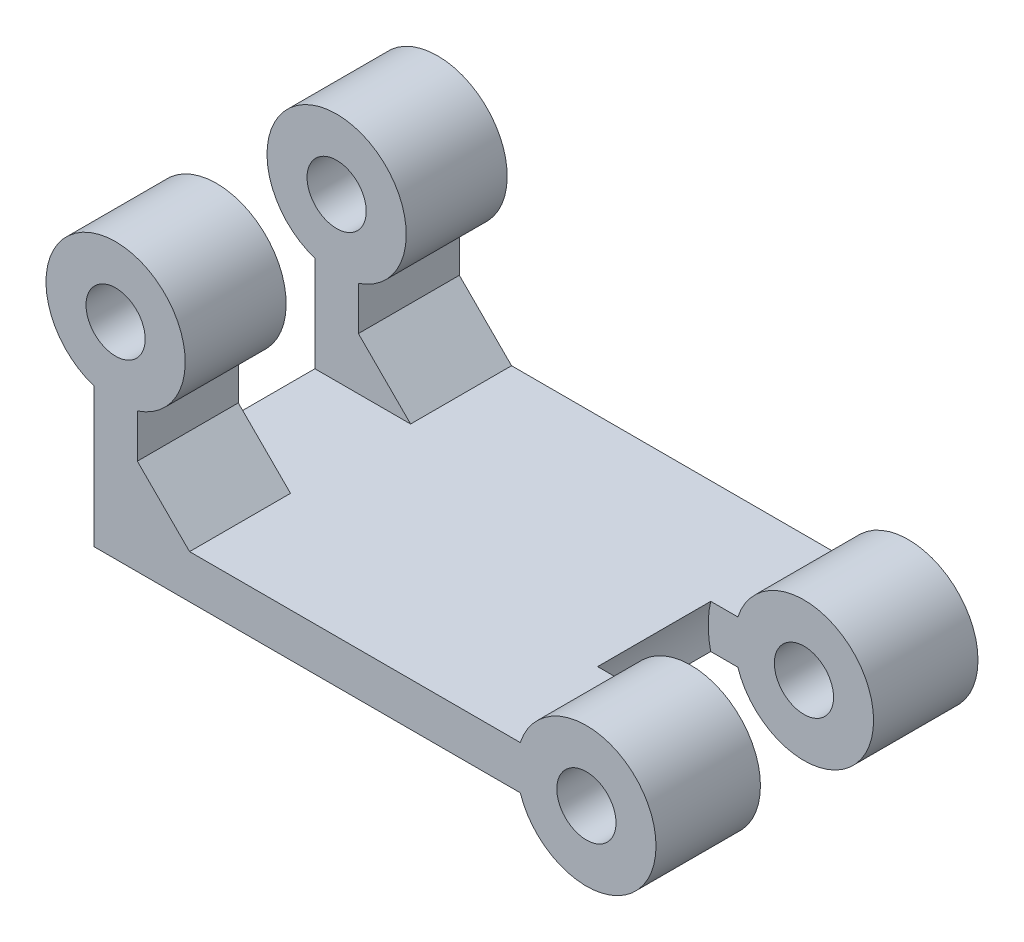
ISO-10303-21;
HEADER;
FILE_DESCRIPTION(('STEP AP214'),'2;1');
FILE_NAME('part.step','',(''),(''),'','','');
FILE_SCHEMA(('AUTOMOTIVE_DESIGN { 1 0 10303 214 1 1 1 1 }'));
ENDSEC;
DATA;
#1=APPLICATION_CONTEXT('core data for automotive mechanical design processes');
#2=APPLICATION_PROTOCOL_DEFINITION('international standard','automotive_design',2000,#1);
#3=PRODUCT_CONTEXT('',#1,'mechanical');
#4=PRODUCT('Part','Part','',(#3));
#5=PRODUCT_RELATED_PRODUCT_CATEGORY('part','',(#4));
#6=PRODUCT_DEFINITION_FORMATION('','',#4);
#7=PRODUCT_DEFINITION_CONTEXT('part definition',#1,'design');
#8=PRODUCT_DEFINITION('design','',#6,#7);
#9=PRODUCT_DEFINITION_SHAPE('','',#8);
#10=(LENGTH_UNIT() NAMED_UNIT(*) SI_UNIT(.MILLI.,.METRE.));
#11=(NAMED_UNIT(*) PLANE_ANGLE_UNIT() SI_UNIT($,.RADIAN.));
#12=(NAMED_UNIT(*) SI_UNIT($,.STERADIAN.) SOLID_ANGLE_UNIT());
#13=UNCERTAINTY_MEASURE_WITH_UNIT(LENGTH_MEASURE(1.E-05),#10,'distance_accuracy_value','');
#14=(GEOMETRIC_REPRESENTATION_CONTEXT(3) GLOBAL_UNCERTAINTY_ASSIGNED_CONTEXT((#13)) GLOBAL_UNIT_ASSIGNED_CONTEXT((#10,
#11,#12)) REPRESENTATION_CONTEXT('',''));
#15=CARTESIAN_POINT('',(0.,0.,0.));
#16=DIRECTION('',(0.,0.,1.));
#17=DIRECTION('',(1.,0.,0.));
#18=AXIS2_PLACEMENT_3D('',#15,#16,#17);
#19=CARTESIAN_POINT('',(-25.7996710383927,1.25,49.9990810170936));
#20=DIRECTION('',(1.,0.,0.));
#21=DIRECTION('',(0.,0.,-1.));
#22=AXIS2_PLACEMENT_3D('',#19,#20,#21);
#23=PLANE('',#22);
#24=DIRECTION('',(0.,-1.,0.));
#25=VECTOR('',#24,1.);
#26=CARTESIAN_POINT('',(-25.7996710383927,1.25,18.5));
#27=LINE('',#26,#25);
#28=CARTESIAN_POINT('',(-25.7996710383927,6.75,18.5));
#29=VERTEX_POINT('',#28);
#30=CARTESIAN_POINT('',(-25.7996710383927,4.25000000000002,18.5));
#31=VERTEX_POINT('',#30);
#32=EDGE_CURVE('E283',#29,#31,#27,.T.);
#33=ORIENTED_EDGE('',*,*,#32,.T.);
#34=DIRECTION('',(0.,0.,-1.));
#35=VECTOR('',#34,1.);
#36=CARTESIAN_POINT('',(-25.7996710383927,4.25000000000002,12.7));
#37=LINE('',#36,#35);
#38=CARTESIAN_POINT('',(-25.7996710383927,4.25000000000002,12.7));
#39=VERTEX_POINT('',#38);
#40=EDGE_CURVE('E205',#31,#39,#37,.T.);
#41=ORIENTED_EDGE('',*,*,#40,.T.);
#42=DIRECTION('',(0.,-1.,0.));
#43=VECTOR('',#42,1.);
#44=CARTESIAN_POINT('',(-25.7996710383927,1.25,12.7));
#45=LINE('',#44,#43);
#46=CARTESIAN_POINT('',(-25.7996710383927,6.75,12.7));
#47=VERTEX_POINT('',#46);
#48=EDGE_CURVE('E348',#47,#39,#45,.T.);
#49=ORIENTED_EDGE('',*,*,#48,.F.);
#50=DIRECTION('',(0.,0.,-1.));
#51=VECTOR('',#50,1.);
#52=CARTESIAN_POINT('',(-25.7996710383927,6.75,49.9990810170936));
#53=LINE('',#52,#51);
#54=EDGE_CURVE('E294',#29,#47,#53,.T.);
#55=ORIENTED_EDGE('',*,*,#54,.F.);
#56=EDGE_LOOP('',(#33,#41,#49,#55));
#57=FACE_BOUND('',#56,.T.);
#58=ADVANCED_FACE('F49',(#57),#23,.T.);
#59=CARTESIAN_POINT('',(-27.0496710383927,10.5496710383927,49.9990810170936));
#60=DIRECTION('',(0.,0.,-1.));
#61=DIRECTION('',(-1.,0.,0.));
#62=AXIS2_PLACEMENT_3D('',#59,#60,#61);
#63=CYLINDRICAL_SURFACE('',#62,4.);
#64=CARTESIAN_POINT('',(-27.0496710383927,10.5496710383927,12.7));
#65=DIRECTION('',(0.,0.,1.));
#66=DIRECTION('',(1.,0.,0.));
#67=AXIS2_PLACEMENT_3D('',#64,#65,#66);
#68=CIRCLE('',#67,4.);
#69=CARTESIAN_POINT('',(-28.2996710383927,6.75,12.7));
#70=VERTEX_POINT('',#69);
#71=EDGE_CURVE('E184',#70,#47,#68,.F.);
#72=ORIENTED_EDGE('',*,*,#71,.F.);
#73=DIRECTION('',(0.,0.,-1.));
#74=VECTOR('',#73,1.);
#75=CARTESIAN_POINT('',(-28.2996710383927,6.75,49.9990810170936));
#76=LINE('',#75,#74);
#77=CARTESIAN_POINT('',(-28.2996710383927,6.75,18.5));
#78=VERTEX_POINT('',#77);
#79=EDGE_CURVE('E190',#78,#70,#76,.T.);
#80=ORIENTED_EDGE('',*,*,#79,.F.);
#81=CARTESIAN_POINT('',(-27.0496710383927,10.5496710383927,18.5));
#82=DIRECTION('',(0.,0.,1.));
#83=DIRECTION('',(1.,0.,0.));
#84=AXIS2_PLACEMENT_3D('',#81,#82,#83);
#85=CIRCLE('',#84,4.);
#86=EDGE_CURVE('E286',#78,#29,#85,.F.);
#87=ORIENTED_EDGE('',*,*,#86,.T.);
#88=ORIENTED_EDGE('',*,*,#54,.T.);
#89=EDGE_LOOP('',(#72,#80,#87,#88));
#90=FACE_BOUND('',#89,.T.);
#91=ADVANCED_FACE('F404',(#90),#63,.T.);
#92=CARTESIAN_POINT('',(-27.0496710383927,10.5496710383927,49.9990810170936));
#93=DIRECTION('',(0.,0.,-1.));
#94=DIRECTION('',(-1.,0.,0.));
#95=AXIS2_PLACEMENT_3D('',#92,#93,#94);
#96=CYLINDRICAL_SURFACE('',#95,1.7);
#97=CARTESIAN_POINT('',(-27.0496710383927,10.5496710383927,12.7));
#98=DIRECTION('',(0.,0.,1.));
#99=DIRECTION('',(1.,0.,0.));
#100=AXIS2_PLACEMENT_3D('',#97,#98,#99);
#101=CIRCLE('',#100,1.7);
#102=CARTESIAN_POINT('',(-25.3496710383927,10.5496710383927,12.7));
#103=VERTEX_POINT('',#102);
#104=EDGE_CURVE('E344',#103,#103,#101,.F.);
#105=ORIENTED_EDGE('',*,*,#104,.T.);
#106=EDGE_LOOP('',(#105));
#107=FACE_BOUND('',#106,.T.);
#108=CARTESIAN_POINT('',(-27.0496710383927,10.5496710383927,18.5));
#109=DIRECTION('',(0.,0.,1.));
#110=DIRECTION('',(1.,0.,0.));
#111=AXIS2_PLACEMENT_3D('',#108,#109,#110);
#112=CIRCLE('',#111,1.7);
#113=CARTESIAN_POINT('',(-25.3496710383927,10.5496710383927,18.5));
#114=VERTEX_POINT('',#113);
#115=EDGE_CURVE('E246',#114,#114,#112,.F.);
#116=ORIENTED_EDGE('',*,*,#115,.F.);
#117=EDGE_LOOP('',(#116));
#118=FACE_BOUND('',#117,.T.);
#119=ADVANCED_FACE('F422',(#107,#118),#96,.F.);
#120=CARTESIAN_POINT('',(0.,0.,6.));
#121=DIRECTION('',(0.,0.,1.));
#122=DIRECTION('',(1.,0.,0.));
#123=AXIS2_PLACEMENT_3D('',#120,#121,#122);
#124=PLANE('',#123);
#125=CARTESIAN_POINT('',(0.,0.,6.));
#126=DIRECTION('',(0.,0.,1.));
#127=DIRECTION('',(1.,0.,0.));
#128=AXIS2_PLACEMENT_3D('',#125,#126,#127);
#129=CIRCLE('',#128,4.);
#130=CARTESIAN_POINT('',(-3.79967103839267,-1.25,6.));
#131=VERTEX_POINT('',#130);
#132=CARTESIAN_POINT('',(-3.79967103839267,1.25,6.));
#133=VERTEX_POINT('',#132);
#134=EDGE_CURVE('E317',#131,#133,#129,.T.);
#135=ORIENTED_EDGE('',*,*,#134,.T.);
#136=DIRECTION('',(1.,0.,0.));
#137=VECTOR('',#136,1.);
#138=CARTESIAN_POINT('',(-3.79967103839267,1.25,6.));
#139=LINE('',#138,#137);
#140=CARTESIAN_POINT('',(-5.35607132140714,1.25,6.));
#141=VERTEX_POINT('',#140);
#142=EDGE_CURVE('E366',#141,#133,#139,.T.);
#143=ORIENTED_EDGE('',*,*,#142,.F.);
#144=CARTESIAN_POINT('',(0.,0.,6.));
#145=DIRECTION('',(0.,0.,1.));
#146=DIRECTION('',(1.,0.,0.));
#147=AXIS2_PLACEMENT_3D('',#144,#145,#146);
#148=CIRCLE('',#147,5.5);
#149=CARTESIAN_POINT('',(-5.35607132140714,-1.25,6.));
#150=VERTEX_POINT('',#149);
#151=EDGE_CURVE('E231',#141,#150,#148,.T.);
#152=ORIENTED_EDGE('',*,*,#151,.T.);
#153=DIRECTION('',(-1.,0.,0.));
#154=VECTOR('',#153,1.);
#155=CARTESIAN_POINT('',(-25.7996710383927,-1.25,6.));
#156=LINE('',#155,#154);
#157=EDGE_CURVE('E329',#131,#150,#156,.T.);
#158=ORIENTED_EDGE('',*,*,#157,.F.);
#159=EDGE_LOOP('',(#135,#143,#152,#158));
#160=FACE_BOUND('',#159,.T.);
#161=CARTESIAN_POINT('',(0.,0.,6.));
#162=DIRECTION('',(0.,0.,1.));
#163=DIRECTION('',(1.,0.,0.));
#164=AXIS2_PLACEMENT_3D('',#161,#162,#163);
#165=CIRCLE('',#164,1.7);
#166=CARTESIAN_POINT('',(1.7,0.,6.));
#167=VERTEX_POINT('',#166);
#168=EDGE_CURVE('E309',#167,#167,#165,.T.);
#169=ORIENTED_EDGE('',*,*,#168,.F.);
#170=EDGE_LOOP('',(#169));
#171=FACE_BOUND('',#170,.T.);
#172=ADVANCED_FACE('F419',(#160,#171),#124,.T.);
#173=CARTESIAN_POINT('',(0.,0.,0.));
#174=DIRECTION('',(0.,0.,1.));
#175=DIRECTION('',(1.,0.,0.));
#176=AXIS2_PLACEMENT_3D('',#173,#174,#175);
#177=PLANE('',#176);
#178=CARTESIAN_POINT('',(0.,0.,0.));
#179=DIRECTION('',(0.,0.,1.));
#180=DIRECTION('',(1.,0.,0.));
#181=AXIS2_PLACEMENT_3D('',#178,#179,#180);
#182=CIRCLE('',#181,4.);
#183=CARTESIAN_POINT('',(-3.79967103839267,-1.25,0.));
#184=VERTEX_POINT('',#183);
#185=CARTESIAN_POINT('',(-3.79967103839267,1.25,0.));
#186=VERTEX_POINT('',#185);
#187=EDGE_CURVE('E313',#184,#186,#182,.T.);
#188=ORIENTED_EDGE('',*,*,#187,.F.);
#189=DIRECTION('',(-1.,0.,0.));
#190=VECTOR('',#189,1.);
#191=CARTESIAN_POINT('',(-25.7996710383927,-1.25,0.));
#192=LINE('',#191,#190);
#193=CARTESIAN_POINT('',(-28.2996710383927,-1.25,0.));
#194=VERTEX_POINT('',#193);
#195=EDGE_CURVE('E265',#184,#194,#192,.T.);
#196=ORIENTED_EDGE('',*,*,#195,.T.);
#197=DIRECTION('',(0.,1.,0.));
#198=VECTOR('',#197,1.);
#199=CARTESIAN_POINT('',(-28.2996710383927,-1.25,0.));
#200=LINE('',#199,#198);
#201=CARTESIAN_POINT('',(-28.2996710383927,6.75,0.));
#202=VERTEX_POINT('',#201);
#203=EDGE_CURVE('E261',#194,#202,#200,.T.);
#204=ORIENTED_EDGE('',*,*,#203,.T.);
#205=CARTESIAN_POINT('',(-27.0496710383927,10.5496710383927,0.));
#206=DIRECTION('',(0.,0.,-1.));
#207=DIRECTION('',(-1.,0.,0.));
#208=AXIS2_PLACEMENT_3D('',#205,#206,#207);
#209=CIRCLE('',#208,4.);
#210=CARTESIAN_POINT('',(-25.7996710383927,6.75,0.));
#211=VERTEX_POINT('',#210);
#212=EDGE_CURVE('E253',#202,#211,#209,.T.);
#213=ORIENTED_EDGE('',*,*,#212,.T.);
#214=DIRECTION('',(0.,-1.,0.));
#215=VECTOR('',#214,1.);
#216=CARTESIAN_POINT('',(-25.7996710383927,1.25,0.));
#217=LINE('',#216,#215);
#218=CARTESIAN_POINT('',(-25.7996710383927,4.25000000000002,0.));
#219=VERTEX_POINT('',#218);
#220=EDGE_CURVE('E241',#211,#219,#217,.T.);
#221=ORIENTED_EDGE('',*,*,#220,.T.);
#222=DIRECTION('',(-0.707106781186544,0.707106781186551,0.));
#223=VECTOR('',#222,1.);
#224=CARTESIAN_POINT('',(-10.7748355191964,-10.7748355191963,0.));
#225=LINE('',#224,#223);
#226=CARTESIAN_POINT('',(-22.7996710383927,1.25,0.));
#227=VERTEX_POINT('',#226);
#228=EDGE_CURVE('E208',#219,#227,#225,.F.);
#229=ORIENTED_EDGE('',*,*,#228,.T.);
#230=DIRECTION('',(1.,0.,0.));
#231=VECTOR('',#230,1.);
#232=CARTESIAN_POINT('',(-3.79967103839267,1.25,0.));
#233=LINE('',#232,#231);
#234=EDGE_CURVE('E238',#227,#186,#233,.T.);
#235=ORIENTED_EDGE('',*,*,#234,.T.);
#236=EDGE_LOOP('',(#188,#196,#204,#213,#221,#229,#235));
#237=FACE_BOUND('',#236,.T.);
#238=CARTESIAN_POINT('',(0.,0.,0.));
#239=DIRECTION('',(0.,0.,1.));
#240=DIRECTION('',(1.,0.,0.));
#241=AXIS2_PLACEMENT_3D('',#238,#239,#240);
#242=CIRCLE('',#241,1.7);
#243=CARTESIAN_POINT('',(1.7,0.,0.));
#244=VERTEX_POINT('',#243);
#245=EDGE_CURVE('E251',#244,#244,#242,.T.);
#246=ORIENTED_EDGE('',*,*,#245,.T.);
#247=EDGE_LOOP('',(#246));
#248=FACE_BOUND('',#247,.T.);
#249=CARTESIAN_POINT('',(-27.0496710383927,10.5496710383927,0.));
#250=DIRECTION('',(0.,0.,-1.));
#251=DIRECTION('',(-1.,0.,0.));
#252=AXIS2_PLACEMENT_3D('',#249,#250,#251);
#253=CIRCLE('',#252,1.7);
#254=CARTESIAN_POINT('',(-28.7496710383927,10.5496710383927,0.));
#255=VERTEX_POINT('',#254);
#256=EDGE_CURVE('E269',#255,#255,#253,.T.);
#257=ORIENTED_EDGE('',*,*,#256,.F.);
#258=EDGE_LOOP('',(#257));
#259=FACE_BOUND('',#258,.T.);
#260=ADVANCED_FACE('F236',(#237,#248,#259),#177,.F.);
#261=CARTESIAN_POINT('',(0.,0.,6.));
#262=DIRECTION('',(0.,0.,-1.));
#263=DIRECTION('',(-1.,0.,0.));
#264=AXIS2_PLACEMENT_3D('',#261,#262,#263);
#265=CYLINDRICAL_SURFACE('',#264,4.);
#266=ORIENTED_EDGE('',*,*,#187,.T.);
#267=DIRECTION('',(0.,0.,-1.));
#268=VECTOR('',#267,1.);
#269=CARTESIAN_POINT('',(-3.79967103839267,1.25,6.));
#270=LINE('',#269,#268);
#271=EDGE_CURVE('E244',#186,#133,#270,.F.);
#272=ORIENTED_EDGE('',*,*,#271,.T.);
#273=ORIENTED_EDGE('',*,*,#134,.F.);
#274=DIRECTION('',(0.,0.,-1.));
#275=VECTOR('',#274,1.);
#276=CARTESIAN_POINT('',(-3.79967103839267,-1.25,6.));
#277=LINE('',#276,#275);
#278=EDGE_CURVE('E321',#131,#184,#277,.T.);
#279=ORIENTED_EDGE('',*,*,#278,.T.);
#280=EDGE_LOOP('',(#266,#272,#273,#279));
#281=FACE_BOUND('',#280,.T.);
#282=ADVANCED_FACE('F418',(#281),#265,.T.);
#283=CARTESIAN_POINT('',(0.,0.,6.));
#284=DIRECTION('',(0.,0.,-1.));
#285=DIRECTION('',(-1.,0.,0.));
#286=AXIS2_PLACEMENT_3D('',#283,#284,#285);
#287=CYLINDRICAL_SURFACE('',#286,1.7);
#288=ORIENTED_EDGE('',*,*,#168,.T.);
#289=EDGE_LOOP('',(#288));
#290=FACE_BOUND('',#289,.T.);
#291=ORIENTED_EDGE('',*,*,#245,.F.);
#292=EDGE_LOOP('',(#291));
#293=FACE_BOUND('',#292,.T.);
#294=ADVANCED_FACE('F426',(#290,#293),#287,.F.);
#295=CARTESIAN_POINT('',(-3.79967103839267,1.25,49.9990810170936));
#296=DIRECTION('',(0.,1.,0.));
#297=DIRECTION('',(0.,0.,1.));
#298=AXIS2_PLACEMENT_3D('',#295,#296,#297);
#299=PLANE('',#298);
#300=ORIENTED_EDGE('',*,*,#234,.F.);
#301=DIRECTION('',(0.,0.,1.));
#302=VECTOR('',#301,1.);
#303=CARTESIAN_POINT('',(-22.7996710383927,1.25,5.8));
#304=LINE('',#303,#302);
#305=CARTESIAN_POINT('',(-22.7996710383927,1.25,5.8));
#306=VERTEX_POINT('',#305);
#307=EDGE_CURVE('E202',#227,#306,#304,.T.);
#308=ORIENTED_EDGE('',*,*,#307,.T.);
#309=DIRECTION('',(-1.,0.,0.));
#310=VECTOR('',#309,1.);
#311=CARTESIAN_POINT('',(-20.3174859461521,1.25,5.8));
#312=LINE('',#311,#310);
#313=CARTESIAN_POINT('',(-28.2996710383927,1.25,5.8));
#314=VERTEX_POINT('',#313);
#315=EDGE_CURVE('E170',#306,#314,#312,.T.);
#316=ORIENTED_EDGE('',*,*,#315,.T.);
#317=DIRECTION('',(0.,0.,-1.));
#318=VECTOR('',#317,1.);
#319=CARTESIAN_POINT('',(-28.2996710383927,1.25,49.9990810170936));
#320=LINE('',#319,#318);
#321=CARTESIAN_POINT('',(-28.2996710383927,1.25,12.7));
#322=VERTEX_POINT('',#321);
#323=EDGE_CURVE('E164',#322,#314,#320,.T.);
#324=ORIENTED_EDGE('',*,*,#323,.F.);
#325=DIRECTION('',(-1.,0.,0.));
#326=VECTOR('',#325,1.);
#327=CARTESIAN_POINT('',(-20.3174859461521,1.25,12.7));
#328=LINE('',#327,#326);
#329=CARTESIAN_POINT('',(-22.7996710383927,1.25,12.7));
#330=VERTEX_POINT('',#329);
#331=EDGE_CURVE('E168',#330,#322,#328,.T.);
#332=ORIENTED_EDGE('',*,*,#331,.F.);
#333=DIRECTION('',(0.,0.,1.));
#334=VECTOR('',#333,1.);
#335=CARTESIAN_POINT('',(-22.7996710383927,1.25,18.5));
#336=LINE('',#335,#334);
#337=CARTESIAN_POINT('',(-22.7996710383927,1.25,18.5));
#338=VERTEX_POINT('',#337);
#339=EDGE_CURVE('E196',#330,#338,#336,.T.);
#340=ORIENTED_EDGE('',*,*,#339,.T.);
#341=DIRECTION('',(1.,0.,0.));
#342=VECTOR('',#341,1.);
#343=CARTESIAN_POINT('',(-3.79967103839267,1.25,18.5));
#344=LINE('',#343,#342);
#345=CARTESIAN_POINT('',(-3.79967103839267,1.25,18.5));
#346=VERTEX_POINT('',#345);
#347=EDGE_CURVE('E278',#338,#346,#344,.T.);
#348=ORIENTED_EDGE('',*,*,#347,.T.);
#349=DIRECTION('',(0.,0.,-1.));
#350=VECTOR('',#349,1.);
#351=CARTESIAN_POINT('',(-3.79967103839267,1.25,49.9990810170936));
#352=LINE('',#351,#350);
#353=CARTESIAN_POINT('',(-3.79967103839267,1.25,12.5));
#354=VERTEX_POINT('',#353);
#355=EDGE_CURVE('E281',#346,#354,#352,.T.);
#356=ORIENTED_EDGE('',*,*,#355,.T.);
#357=DIRECTION('',(1.,0.,0.));
#358=VECTOR('',#357,1.);
#359=CARTESIAN_POINT('',(-3.79967103839267,1.25,12.5));
#360=LINE('',#359,#358);
#361=CARTESIAN_POINT('',(-5.35607132140714,1.25,12.5));
#362=VERTEX_POINT('',#361);
#363=EDGE_CURVE('E363',#362,#354,#360,.T.);
#364=ORIENTED_EDGE('',*,*,#363,.F.);
#365=DIRECTION('',(0.,0.,-1.));
#366=VECTOR('',#365,1.);
#367=CARTESIAN_POINT('',(-5.35607132140714,1.25,12.5));
#368=LINE('',#367,#366);
#369=EDGE_CURVE('E369',#362,#141,#368,.T.);
#370=ORIENTED_EDGE('',*,*,#369,.T.);
#371=ORIENTED_EDGE('',*,*,#142,.T.);
#372=ORIENTED_EDGE('',*,*,#271,.F.);
#373=EDGE_LOOP('',(#300,#308,#316,#324,#332,#340,#348,#356,#364,#370,#371,#372));
#374=FACE_BOUND('',#373,.T.);
#375=ADVANCED_FACE('F167',(#374),#299,.T.);
#376=DIRECTION('',(0.,1.,0.));
#377=VECTOR('',#376,1.);
#378=CARTESIAN_POINT('',(-25.7996710383927,1.25,5.8));
#379=LINE('',#378,#377);
#380=CARTESIAN_POINT('',(-25.7996710383927,4.25000000000002,5.8));
#381=VERTEX_POINT('',#380);
#382=CARTESIAN_POINT('',(-25.7996710383927,6.75,5.8));
#383=VERTEX_POINT('',#382);
#384=EDGE_CURVE('E219',#381,#383,#379,.T.);
#385=ORIENTED_EDGE('',*,*,#384,.F.);
#386=DIRECTION('',(0.,0.,-1.));
#387=VECTOR('',#386,1.);
#388=CARTESIAN_POINT('',(-25.7996710383927,4.25000000000002,0.));
#389=LINE('',#388,#387);
#390=EDGE_CURVE('E192',#381,#219,#389,.T.);
#391=ORIENTED_EDGE('',*,*,#390,.T.);
#392=ORIENTED_EDGE('',*,*,#220,.F.);
#393=EDGE_CURVE('E229',#383,#211,#53,.T.);
#394=ORIENTED_EDGE('',*,*,#393,.F.);
#395=EDGE_LOOP('',(#385,#391,#392,#394));
#396=FACE_BOUND('',#395,.T.);
#397=ADVANCED_FACE('F226',(#396),#23,.T.);
#398=CARTESIAN_POINT('',(-27.0496710383927,10.5496710383927,5.8));
#399=DIRECTION('',(0.,0.,-1.));
#400=DIRECTION('',(-1.,0.,0.));
#401=AXIS2_PLACEMENT_3D('',#398,#399,#400);
#402=CIRCLE('',#401,4.);
#403=CARTESIAN_POINT('',(-28.2996710383927,6.75,5.8));
#404=VERTEX_POINT('',#403);
#405=EDGE_CURVE('E232',#383,#404,#402,.F.);
#406=ORIENTED_EDGE('',*,*,#405,.F.);
#407=ORIENTED_EDGE('',*,*,#393,.T.);
#408=ORIENTED_EDGE('',*,*,#212,.F.);
#409=EDGE_CURVE('E293',#404,#202,#76,.T.);
#410=ORIENTED_EDGE('',*,*,#409,.F.);
#411=EDGE_LOOP('',(#406,#407,#408,#410));
#412=FACE_BOUND('',#411,.T.);
#413=ADVANCED_FACE('F456',(#412),#63,.T.);
#414=CARTESIAN_POINT('',(-28.2996710383927,-1.25,49.9990810170936));
#415=DIRECTION('',(-1.,0.,0.));
#416=DIRECTION('',(0.,-1.,0.));
#417=AXIS2_PLACEMENT_3D('',#414,#415,#416);
#418=PLANE('',#417);
#419=DIRECTION('',(0.,1.,0.));
#420=VECTOR('',#419,1.);
#421=CARTESIAN_POINT('',(-28.2996710383927,-1.25,12.7));
#422=LINE('',#421,#420);
#423=EDGE_CURVE('E175',#322,#70,#422,.T.);
#424=ORIENTED_EDGE('',*,*,#423,.F.);
#425=ORIENTED_EDGE('',*,*,#323,.T.);
#426=DIRECTION('',(0.,-1.,0.));
#427=VECTOR('',#426,1.);
#428=CARTESIAN_POINT('',(-28.2996710383927,-1.25,5.8));
#429=LINE('',#428,#427);
#430=EDGE_CURVE('E338',#404,#314,#429,.T.);
#431=ORIENTED_EDGE('',*,*,#430,.F.);
#432=ORIENTED_EDGE('',*,*,#409,.T.);
#433=ORIENTED_EDGE('',*,*,#203,.F.);
#434=DIRECTION('',(0.,0.,-1.));
#435=VECTOR('',#434,1.);
#436=CARTESIAN_POINT('',(-28.2996710383927,-1.25,49.9990810170936));
#437=LINE('',#436,#435);
#438=CARTESIAN_POINT('',(-28.2996710383927,-1.25,18.5));
#439=VERTEX_POINT('',#438);
#440=EDGE_CURVE('E272',#439,#194,#437,.T.);
#441=ORIENTED_EDGE('',*,*,#440,.F.);
#442=DIRECTION('',(0.,1.,0.));
#443=VECTOR('',#442,1.);
#444=CARTESIAN_POINT('',(-28.2996710383927,-1.25,18.5));
#445=LINE('',#444,#443);
#446=EDGE_CURVE('E290',#439,#78,#445,.T.);
#447=ORIENTED_EDGE('',*,*,#446,.T.);
#448=ORIENTED_EDGE('',*,*,#79,.T.);
#449=EDGE_LOOP('',(#424,#425,#431,#432,#433,#441,#447,#448));
#450=FACE_BOUND('',#449,.T.);
#451=ADVANCED_FACE('F187',(#450),#418,.T.);
#452=CARTESIAN_POINT('',(-25.7996710383927,-1.25,49.9990810170936));
#453=DIRECTION('',(0.,-1.,0.));
#454=DIRECTION('',(0.,0.,-1.));
#455=AXIS2_PLACEMENT_3D('',#452,#453,#454);
#456=PLANE('',#455);
#457=DIRECTION('',(-1.,0.,0.));
#458=VECTOR('',#457,1.);
#459=CARTESIAN_POINT('',(-25.7996710383927,-1.25,12.5));
#460=LINE('',#459,#458);
#461=CARTESIAN_POINT('',(-3.79967103839267,-1.25,12.5));
#462=VERTEX_POINT('',#461);
#463=CARTESIAN_POINT('',(-5.35607132140714,-1.25,12.5));
#464=VERTEX_POINT('',#463);
#465=EDGE_CURVE('E358',#462,#464,#460,.T.);
#466=ORIENTED_EDGE('',*,*,#465,.F.);
#467=DIRECTION('',(0.,0.,-1.));
#468=VECTOR('',#467,1.);
#469=CARTESIAN_POINT('',(-3.79967103839267,-1.25,49.9990810170936));
#470=LINE('',#469,#468);
#471=CARTESIAN_POINT('',(-3.79967103839267,-1.25,18.5));
#472=VERTEX_POINT('',#471);
#473=EDGE_CURVE('E282',#472,#462,#470,.T.);
#474=ORIENTED_EDGE('',*,*,#473,.F.);
#475=DIRECTION('',(-1.,0.,0.));
#476=VECTOR('',#475,1.);
#477=CARTESIAN_POINT('',(-25.7996710383927,-1.25,18.5));
#478=LINE('',#477,#476);
#479=EDGE_CURVE('E274',#472,#439,#478,.T.);
#480=ORIENTED_EDGE('',*,*,#479,.T.);
#481=ORIENTED_EDGE('',*,*,#440,.T.);
#482=ORIENTED_EDGE('',*,*,#195,.F.);
#483=ORIENTED_EDGE('',*,*,#278,.F.);
#484=ORIENTED_EDGE('',*,*,#157,.T.);
#485=DIRECTION('',(0.,0.,-1.));
#486=VECTOR('',#485,1.);
#487=CARTESIAN_POINT('',(-5.35607132140714,-1.25,12.5));
#488=LINE('',#487,#486);
#489=EDGE_CURVE('E176',#150,#464,#488,.F.);
#490=ORIENTED_EDGE('',*,*,#489,.T.);
#491=EDGE_LOOP('',(#466,#474,#480,#481,#482,#483,#484,#490));
#492=FACE_BOUND('',#491,.T.);
#493=ADVANCED_FACE('F409',(#492),#456,.T.);
#494=CARTESIAN_POINT('',(-27.0496710383927,10.5496710383927,5.8));
#495=DIRECTION('',(0.,0.,-1.));
#496=DIRECTION('',(-1.,0.,0.));
#497=AXIS2_PLACEMENT_3D('',#494,#495,#496);
#498=CIRCLE('',#497,1.7);
#499=CARTESIAN_POINT('',(-28.7496710383927,10.5496710383927,5.8));
#500=VERTEX_POINT('',#499);
#501=EDGE_CURVE('E335',#500,#500,#498,.F.);
#502=ORIENTED_EDGE('',*,*,#501,.T.);
#503=EDGE_LOOP('',(#502));
#504=FACE_BOUND('',#503,.T.);
#505=ORIENTED_EDGE('',*,*,#256,.T.);
#506=EDGE_LOOP('',(#505));
#507=FACE_BOUND('',#506,.T.);
#508=ADVANCED_FACE('F436',(#504,#507),#96,.F.);
#509=CARTESIAN_POINT('',(0.,0.,18.5));
#510=DIRECTION('',(0.,0.,1.));
#511=DIRECTION('',(1.,0.,0.));
#512=AXIS2_PLACEMENT_3D('',#509,#510,#511);
#513=PLANE('',#512);
#514=ORIENTED_EDGE('',*,*,#479,.F.);
#515=CARTESIAN_POINT('',(0.,0.,18.5));
#516=DIRECTION('',(0.,0.,1.));
#517=DIRECTION('',(1.,0.,0.));
#518=AXIS2_PLACEMENT_3D('',#515,#516,#517);
#519=CIRCLE('',#518,4.);
#520=EDGE_CURVE('E308',#472,#346,#519,.T.);
#521=ORIENTED_EDGE('',*,*,#520,.T.);
#522=ORIENTED_EDGE('',*,*,#347,.F.);
#523=DIRECTION('',(0.707106781186544,-0.707106781186551,0.));
#524=VECTOR('',#523,1.);
#525=CARTESIAN_POINT('',(-25.7996710383927,4.25000000000002,18.5));
#526=LINE('',#525,#524);
#527=EDGE_CURVE('E11',#338,#31,#526,.F.);
#528=ORIENTED_EDGE('',*,*,#527,.T.);
#529=ORIENTED_EDGE('',*,*,#32,.F.);
#530=ORIENTED_EDGE('',*,*,#86,.F.);
#531=ORIENTED_EDGE('',*,*,#446,.F.);
#532=EDGE_LOOP('',(#514,#521,#522,#528,#529,#530,#531));
#533=FACE_BOUND('',#532,.T.);
#534=ORIENTED_EDGE('',*,*,#115,.T.);
#535=EDGE_LOOP('',(#534));
#536=FACE_BOUND('',#535,.T.);
#537=CARTESIAN_POINT('',(0.,0.,18.5));
#538=DIRECTION('',(0.,0.,1.));
#539=DIRECTION('',(1.,0.,0.));
#540=AXIS2_PLACEMENT_3D('',#537,#538,#539);
#541=CIRCLE('',#540,1.7);
#542=CARTESIAN_POINT('',(1.7,0.,18.5));
#543=VERTEX_POINT('',#542);
#544=EDGE_CURVE('E374',#543,#543,#541,.T.);
#545=ORIENTED_EDGE('',*,*,#544,.F.);
#546=EDGE_LOOP('',(#545));
#547=FACE_BOUND('',#546,.T.);
#548=ADVANCED_FACE('F395',(#533,#536,#547),#513,.T.);
#549=CARTESIAN_POINT('',(0.,0.,12.5));
#550=DIRECTION('',(0.,0.,1.));
#551=DIRECTION('',(1.,0.,0.));
#552=AXIS2_PLACEMENT_3D('',#549,#550,#551);
#553=PLANE('',#552);
#554=CARTESIAN_POINT('',(0.,0.,12.5));
#555=DIRECTION('',(0.,0.,1.));
#556=DIRECTION('',(1.,0.,0.));
#557=AXIS2_PLACEMENT_3D('',#554,#555,#556);
#558=CIRCLE('',#557,4.);
#559=EDGE_CURVE('E256',#462,#354,#558,.T.);
#560=ORIENTED_EDGE('',*,*,#559,.F.);
#561=ORIENTED_EDGE('',*,*,#465,.T.);
#562=CARTESIAN_POINT('',(0.,0.,12.5));
#563=DIRECTION('',(0.,0.,1.));
#564=DIRECTION('',(1.,0.,0.));
#565=AXIS2_PLACEMENT_3D('',#562,#563,#564);
#566=CIRCLE('',#565,5.5);
#567=EDGE_CURVE('E354',#362,#464,#566,.T.);
#568=ORIENTED_EDGE('',*,*,#567,.F.);
#569=ORIENTED_EDGE('',*,*,#363,.T.);
#570=EDGE_LOOP('',(#560,#561,#568,#569));
#571=FACE_BOUND('',#570,.T.);
#572=CARTESIAN_POINT('',(0.,0.,12.5));
#573=DIRECTION('',(0.,0.,1.));
#574=DIRECTION('',(1.,0.,0.));
#575=AXIS2_PLACEMENT_3D('',#572,#573,#574);
#576=CIRCLE('',#575,1.7);
#577=CARTESIAN_POINT('',(1.7,0.,12.5));
#578=VERTEX_POINT('',#577);
#579=EDGE_CURVE('E373',#578,#578,#576,.T.);
#580=ORIENTED_EDGE('',*,*,#579,.T.);
#581=EDGE_LOOP('',(#580));
#582=FACE_BOUND('',#581,.T.);
#583=ADVANCED_FACE('F391',(#571,#582),#553,.F.);
#584=CARTESIAN_POINT('',(0.,0.,18.5));
#585=DIRECTION('',(0.,0.,-1.));
#586=DIRECTION('',(-1.,0.,0.));
#587=AXIS2_PLACEMENT_3D('',#584,#585,#586);
#588=CYLINDRICAL_SURFACE('',#587,4.);
#589=ORIENTED_EDGE('',*,*,#355,.F.);
#590=ORIENTED_EDGE('',*,*,#520,.F.);
#591=ORIENTED_EDGE('',*,*,#473,.T.);
#592=ORIENTED_EDGE('',*,*,#559,.T.);
#593=EDGE_LOOP('',(#589,#590,#591,#592));
#594=FACE_BOUND('',#593,.T.);
#595=ADVANCED_FACE('F388',(#594),#588,.T.);
#596=CARTESIAN_POINT('',(0.,0.,18.5));
#597=DIRECTION('',(0.,0.,-1.));
#598=DIRECTION('',(-1.,0.,0.));
#599=AXIS2_PLACEMENT_3D('',#596,#597,#598);
#600=CYLINDRICAL_SURFACE('',#599,1.7);
#601=ORIENTED_EDGE('',*,*,#544,.T.);
#602=EDGE_LOOP('',(#601));
#603=FACE_BOUND('',#602,.T.);
#604=ORIENTED_EDGE('',*,*,#579,.F.);
#605=EDGE_LOOP('',(#604));
#606=FACE_BOUND('',#605,.T.);
#607=ADVANCED_FACE('F554',(#603,#606),#600,.F.);
#608=CARTESIAN_POINT('',(0.,0.,12.5));
#609=DIRECTION('',(0.,0.,-1.));
#610=DIRECTION('',(-1.,0.,0.));
#611=AXIS2_PLACEMENT_3D('',#608,#609,#610);
#612=CYLINDRICAL_SURFACE('',#611,5.5);
#613=ORIENTED_EDGE('',*,*,#567,.T.);
#614=ORIENTED_EDGE('',*,*,#489,.F.);
#615=ORIENTED_EDGE('',*,*,#151,.F.);
#616=ORIENTED_EDGE('',*,*,#369,.F.);
#617=EDGE_LOOP('',(#613,#614,#615,#616));
#618=FACE_BOUND('',#617,.T.);
#619=ADVANCED_FACE('F414',(#618),#612,.F.);
#620=CARTESIAN_POINT('',(0.,0.,5.8));
#621=DIRECTION('',(0.,0.,-1.));
#622=DIRECTION('',(-1.,0.,0.));
#623=AXIS2_PLACEMENT_3D('',#620,#621,#622);
#624=PLANE('',#623);
#625=ORIENTED_EDGE('',*,*,#315,.F.);
#626=DIRECTION('',(0.707106781186544,-0.707106781186551,0.));
#627=VECTOR('',#626,1.);
#628=CARTESIAN_POINT('',(-10.7748355191964,-10.7748355191963,5.8));
#629=LINE('',#628,#627);
#630=EDGE_CURVE('E211',#306,#381,#629,.F.);
#631=ORIENTED_EDGE('',*,*,#630,.T.);
#632=ORIENTED_EDGE('',*,*,#384,.T.);
#633=ORIENTED_EDGE('',*,*,#405,.T.);
#634=ORIENTED_EDGE('',*,*,#430,.T.);
#635=EDGE_LOOP('',(#625,#631,#632,#633,#634));
#636=FACE_BOUND('',#635,.T.);
#637=ORIENTED_EDGE('',*,*,#501,.F.);
#638=EDGE_LOOP('',(#637));
#639=FACE_BOUND('',#638,.T.);
#640=ADVANCED_FACE('F217',(#636,#639),#624,.F.);
#641=CARTESIAN_POINT('',(0.,0.,12.7));
#642=DIRECTION('',(0.,0.,1.));
#643=DIRECTION('',(-1.,0.,0.));
#644=AXIS2_PLACEMENT_3D('',#641,#642,#643);
#645=PLANE('',#644);
#646=ORIENTED_EDGE('',*,*,#48,.T.);
#647=DIRECTION('',(-0.707106781186544,0.707106781186551,0.));
#648=VECTOR('',#647,1.);
#649=CARTESIAN_POINT('',(-10.7748355191964,-10.7748355191963,12.7));
#650=LINE('',#649,#648);
#651=EDGE_CURVE('E59',#39,#330,#650,.F.);
#652=ORIENTED_EDGE('',*,*,#651,.T.);
#653=ORIENTED_EDGE('',*,*,#331,.T.);
#654=ORIENTED_EDGE('',*,*,#423,.T.);
#655=ORIENTED_EDGE('',*,*,#71,.T.);
#656=EDGE_LOOP('',(#646,#652,#653,#654,#655));
#657=FACE_BOUND('',#656,.T.);
#658=ORIENTED_EDGE('',*,*,#104,.F.);
#659=EDGE_LOOP('',(#658));
#660=FACE_BOUND('',#659,.T.);
#661=ADVANCED_FACE('F180',(#657,#660),#645,.F.);
#662=CARTESIAN_POINT('',(-25.7996710383927,4.25000000000002,49.9990810170936));
#663=DIRECTION('',(0.707106781186551,0.707106781186544,0.));
#664=DIRECTION('',(0.,0.,1.));
#665=AXIS2_PLACEMENT_3D('',#662,#663,#664);
#666=PLANE('',#665);
#667=ORIENTED_EDGE('',*,*,#630,.F.);
#668=ORIENTED_EDGE('',*,*,#307,.F.);
#669=ORIENTED_EDGE('',*,*,#228,.F.);
#670=ORIENTED_EDGE('',*,*,#390,.F.);
#671=EDGE_LOOP('',(#667,#668,#669,#670));
#672=FACE_BOUND('',#671,.T.);
#673=ADVANCED_FACE('F234',(#672),#666,.T.);
#674=CARTESIAN_POINT('',(-25.7996710383927,4.25000000000002,49.9990810170936));
#675=DIRECTION('',(0.707106781186551,0.707106781186544,0.));
#676=DIRECTION('',(0.,0.,1.));
#677=AXIS2_PLACEMENT_3D('',#674,#675,#676);
#678=PLANE('',#677);
#679=ORIENTED_EDGE('',*,*,#527,.F.);
#680=ORIENTED_EDGE('',*,*,#339,.F.);
#681=ORIENTED_EDGE('',*,*,#651,.F.);
#682=ORIENTED_EDGE('',*,*,#40,.F.);
#683=EDGE_LOOP('',(#679,#680,#681,#682));
#684=FACE_BOUND('',#683,.T.);
#685=ADVANCED_FACE('F52',(#684),#678,.T.);
#686=CLOSED_SHELL('',(#58,#91,#119,#172,#260,#282,#294,#375,#397,#413,#451,#493,#508,#548,#583,
#595,#607,#619,#640,#661,#673,#685));
#687=MANIFOLD_SOLID_BREP('B2',#686);
#688=ADVANCED_BREP_SHAPE_REPRESENTATION('',(#18,#687),#14);
#689=SHAPE_DEFINITION_REPRESENTATION(#9,#688);
ENDSEC;
END-ISO-10303-21;
